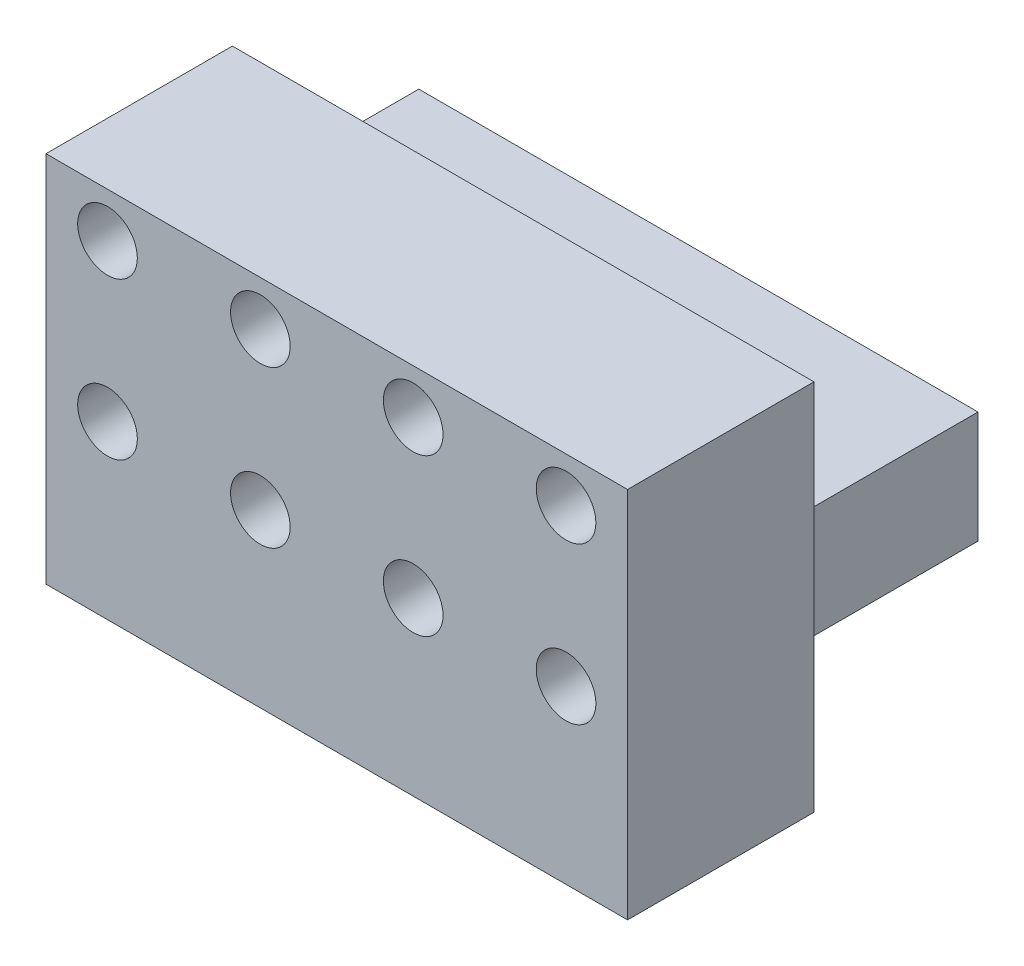
ISO-10303-21;
HEADER;
FILE_DESCRIPTION(('STEP AP214'),'2;1');
FILE_NAME('part.step','',(''),(''),'','','');
FILE_SCHEMA(('AUTOMOTIVE_DESIGN { 1 0 10303 214 1 1 1 1 }'));
ENDSEC;
DATA;
#1=APPLICATION_CONTEXT('core data for automotive mechanical design processes');
#2=APPLICATION_PROTOCOL_DEFINITION('international standard','automotive_design',2000,#1);
#3=PRODUCT_CONTEXT('',#1,'mechanical');
#4=PRODUCT('Part','Part','',(#3));
#5=PRODUCT_RELATED_PRODUCT_CATEGORY('part','',(#4));
#6=PRODUCT_DEFINITION_FORMATION('','',#4);
#7=PRODUCT_DEFINITION_CONTEXT('part definition',#1,'design');
#8=PRODUCT_DEFINITION('design','',#6,#7);
#9=PRODUCT_DEFINITION_SHAPE('','',#8);
#10=(LENGTH_UNIT() NAMED_UNIT(*) SI_UNIT(.MILLI.,.METRE.));
#11=(NAMED_UNIT(*) PLANE_ANGLE_UNIT() SI_UNIT($,.RADIAN.));
#12=(NAMED_UNIT(*) SI_UNIT($,.STERADIAN.) SOLID_ANGLE_UNIT());
#13=UNCERTAINTY_MEASURE_WITH_UNIT(LENGTH_MEASURE(1.E-05),#10,'distance_accuracy_value','');
#14=(GEOMETRIC_REPRESENTATION_CONTEXT(3) GLOBAL_UNCERTAINTY_ASSIGNED_CONTEXT((#13)) GLOBAL_UNIT_ASSIGNED_CONTEXT((#10,
#11,#12)) REPRESENTATION_CONTEXT('',''));
#15=CARTESIAN_POINT('',(0.,0.,0.));
#16=DIRECTION('',(0.,0.,1.));
#17=DIRECTION('',(1.,0.,0.));
#18=AXIS2_PLACEMENT_3D('',#15,#16,#17);
#19=CARTESIAN_POINT('',(0.,7.62,12.7));
#20=DIRECTION('',(-1.,0.,0.));
#21=DIRECTION('',(0.,0.,1.));
#22=AXIS2_PLACEMENT_3D('',#19,#20,#21);
#23=PLANE('',#22);
#24=DIRECTION('',(0.,1.,0.));
#25=VECTOR('',#24,1.);
#26=CARTESIAN_POINT('',(0.,7.62,0.));
#27=LINE('',#26,#25);
#28=CARTESIAN_POINT('',(0.,0.,0.));
#29=VERTEX_POINT('',#28);
#30=CARTESIAN_POINT('',(0.,7.62,0.));
#31=VERTEX_POINT('',#30);
#32=EDGE_CURVE('E129',#29,#31,#27,.T.);
#33=ORIENTED_EDGE('',*,*,#32,.T.);
#34=DIRECTION('',(0.,0.,-1.));
#35=VECTOR('',#34,1.);
#36=CARTESIAN_POINT('',(0.,7.62,12.7));
#37=LINE('',#36,#35);
#38=CARTESIAN_POINT('',(0.,7.62,12.7));
#39=VERTEX_POINT('',#38);
#40=EDGE_CURVE('E11',#39,#31,#37,.T.);
#41=ORIENTED_EDGE('',*,*,#40,.F.);
#42=DIRECTION('',(0.,1.,0.));
#43=VECTOR('',#42,1.);
#44=CARTESIAN_POINT('',(0.,7.62,12.7));
#45=LINE('',#44,#43);
#46=CARTESIAN_POINT('',(0.,0.,12.7));
#47=VERTEX_POINT('',#46);
#48=EDGE_CURVE('E138',#47,#39,#45,.T.);
#49=ORIENTED_EDGE('',*,*,#48,.F.);
#50=DIRECTION('',(0.,0.,-1.));
#51=VECTOR('',#50,1.);
#52=CARTESIAN_POINT('',(0.,0.,12.7));
#53=LINE('',#52,#51);
#54=EDGE_CURVE('E144',#47,#29,#53,.T.);
#55=ORIENTED_EDGE('',*,*,#54,.T.);
#56=EDGE_LOOP('',(#33,#41,#49,#55));
#57=FACE_BOUND('',#56,.T.);
#58=ADVANCED_FACE('F32',(#57),#23,.F.);
#59=CARTESIAN_POINT('',(-38.1,7.62,12.7));
#60=DIRECTION('',(0.,-1.,0.));
#61=DIRECTION('',(1.,0.,0.));
#62=AXIS2_PLACEMENT_3D('',#59,#60,#61);
#63=PLANE('',#62);
#64=DIRECTION('',(-1.,0.,0.));
#65=VECTOR('',#64,1.);
#66=CARTESIAN_POINT('',(-38.1,7.62,0.));
#67=LINE('',#66,#65);
#68=CARTESIAN_POINT('',(-38.1,7.62,0.));
#69=VERTEX_POINT('',#68);
#70=EDGE_CURVE('E132',#31,#69,#67,.T.);
#71=ORIENTED_EDGE('',*,*,#70,.T.);
#72=DIRECTION('',(0.,0.,-1.));
#73=VECTOR('',#72,1.);
#74=CARTESIAN_POINT('',(-38.1,7.62,12.7));
#75=LINE('',#74,#73);
#76=CARTESIAN_POINT('',(-38.1,7.62,12.7));
#77=VERTEX_POINT('',#76);
#78=EDGE_CURVE('E40',#77,#69,#75,.T.);
#79=ORIENTED_EDGE('',*,*,#78,.F.);
#80=DIRECTION('',(-1.,0.,0.));
#81=VECTOR('',#80,1.);
#82=CARTESIAN_POINT('',(-38.1,7.62,12.7));
#83=LINE('',#82,#81);
#84=EDGE_CURVE('E74',#39,#77,#83,.T.);
#85=ORIENTED_EDGE('',*,*,#84,.F.);
#86=ORIENTED_EDGE('',*,*,#40,.T.);
#87=EDGE_LOOP('',(#71,#79,#85,#86));
#88=FACE_BOUND('',#87,.T.);
#89=ADVANCED_FACE('F259',(#88),#63,.F.);
#90=CARTESIAN_POINT('',(-38.1,0.,12.7));
#91=DIRECTION('',(1.,0.,0.));
#92=DIRECTION('',(0.,0.,-1.));
#93=AXIS2_PLACEMENT_3D('',#90,#91,#92);
#94=PLANE('',#93);
#95=DIRECTION('',(0.,-1.,0.));
#96=VECTOR('',#95,1.);
#97=CARTESIAN_POINT('',(-38.1,0.,0.));
#98=LINE('',#97,#96);
#99=CARTESIAN_POINT('',(-38.1,0.,0.));
#100=VERTEX_POINT('',#99);
#101=EDGE_CURVE('E64',#69,#100,#98,.T.);
#102=ORIENTED_EDGE('',*,*,#101,.T.);
#103=DIRECTION('',(0.,0.,-1.));
#104=VECTOR('',#103,1.);
#105=CARTESIAN_POINT('',(-38.1,0.,12.7));
#106=LINE('',#105,#104);
#107=CARTESIAN_POINT('',(-38.1,0.,12.7));
#108=VERTEX_POINT('',#107);
#109=EDGE_CURVE('E48',#108,#100,#106,.T.);
#110=ORIENTED_EDGE('',*,*,#109,.F.);
#111=DIRECTION('',(0.,-1.,0.));
#112=VECTOR('',#111,1.);
#113=CARTESIAN_POINT('',(-38.1,16.51,12.7));
#114=LINE('',#113,#112);
#115=CARTESIAN_POINT('',(-38.1,-8.89,12.7));
#116=VERTEX_POINT('',#115);
#117=EDGE_CURVE('E163',#108,#116,#114,.T.);
#118=ORIENTED_EDGE('',*,*,#117,.T.);
#119=DIRECTION('',(0.,0.,-1.));
#120=VECTOR('',#119,1.);
#121=CARTESIAN_POINT('',(-38.1,-8.89,25.4));
#122=LINE('',#121,#120);
#123=CARTESIAN_POINT('',(-38.1,-8.89,25.4));
#124=VERTEX_POINT('',#123);
#125=EDGE_CURVE('E134',#124,#116,#122,.T.);
#126=ORIENTED_EDGE('',*,*,#125,.F.);
#127=DIRECTION('',(0.,-1.,0.));
#128=VECTOR('',#127,1.);
#129=CARTESIAN_POINT('',(-38.1,16.51,25.4));
#130=LINE('',#129,#128);
#131=CARTESIAN_POINT('',(-38.1,16.51,25.4));
#132=VERTEX_POINT('',#131);
#133=EDGE_CURVE('E114',#132,#124,#130,.T.);
#134=ORIENTED_EDGE('',*,*,#133,.F.);
#135=DIRECTION('',(0.,0.,-1.));
#136=VECTOR('',#135,1.);
#137=CARTESIAN_POINT('',(-38.1,16.51,25.4));
#138=LINE('',#137,#136);
#139=CARTESIAN_POINT('',(-38.1,16.51,12.7));
#140=VERTEX_POINT('',#139);
#141=EDGE_CURVE('E111',#132,#140,#138,.T.);
#142=ORIENTED_EDGE('',*,*,#141,.T.);
#143=EDGE_CURVE('E153',#140,#77,#114,.T.);
#144=ORIENTED_EDGE('',*,*,#143,.T.);
#145=ORIENTED_EDGE('',*,*,#78,.T.);
#146=EDGE_LOOP('',(#102,#110,#118,#126,#134,#142,#144,#145));
#147=FACE_BOUND('',#146,.T.);
#148=ADVANCED_FACE('F151',(#147),#94,.F.);
#149=CARTESIAN_POINT('',(0.,0.,12.7));
#150=DIRECTION('',(0.,1.,0.));
#151=DIRECTION('',(-1.,0.,0.));
#152=AXIS2_PLACEMENT_3D('',#149,#150,#151);
#153=PLANE('',#152);
#154=DIRECTION('',(1.,0.,0.));
#155=VECTOR('',#154,1.);
#156=CARTESIAN_POINT('',(0.,0.,0.));
#157=LINE('',#156,#155);
#158=EDGE_CURVE('E69',#100,#29,#157,.T.);
#159=ORIENTED_EDGE('',*,*,#158,.T.);
#160=ORIENTED_EDGE('',*,*,#54,.F.);
#161=DIRECTION('',(1.,0.,0.));
#162=VECTOR('',#161,1.);
#163=CARTESIAN_POINT('',(0.,0.,12.7));
#164=LINE('',#163,#162);
#165=EDGE_CURVE('E142',#108,#47,#164,.T.);
#166=ORIENTED_EDGE('',*,*,#165,.F.);
#167=ORIENTED_EDGE('',*,*,#109,.T.);
#168=EDGE_LOOP('',(#159,#160,#166,#167));
#169=FACE_BOUND('',#168,.T.);
#170=ADVANCED_FACE('F158',(#169),#153,.F.);
#171=CARTESIAN_POINT('',(0.,0.,0.));
#172=DIRECTION('',(0.,0.,-1.));
#173=DIRECTION('',(-1.,0.,0.));
#174=AXIS2_PLACEMENT_3D('',#171,#172,#173);
#175=PLANE('',#174);
#176=ORIENTED_EDGE('',*,*,#32,.F.);
#177=ORIENTED_EDGE('',*,*,#158,.F.);
#178=ORIENTED_EDGE('',*,*,#101,.F.);
#179=ORIENTED_EDGE('',*,*,#70,.F.);
#180=EDGE_LOOP('',(#176,#177,#178,#179));
#181=FACE_BOUND('',#180,.T.);
#182=ADVANCED_FACE('F156',(#181),#175,.T.);
#183=CARTESIAN_POINT('',(0.,0.,12.7));
#184=DIRECTION('',(0.,0.,1.));
#185=DIRECTION('',(1.,0.,0.));
#186=AXIS2_PLACEMENT_3D('',#183,#184,#185);
#187=PLANE('',#186);
#188=ORIENTED_EDGE('',*,*,#48,.T.);
#189=ORIENTED_EDGE('',*,*,#84,.T.);
#190=ORIENTED_EDGE('',*,*,#143,.F.);
#191=DIRECTION('',(-1.,0.,0.));
#192=VECTOR('',#191,1.);
#193=CARTESIAN_POINT('',(-38.1,16.51,12.7));
#194=LINE('',#193,#192);
#195=CARTESIAN_POINT('',(1.52399999999999,16.51,12.7));
#196=VERTEX_POINT('',#195);
#197=EDGE_CURVE('E166',#196,#140,#194,.T.);
#198=ORIENTED_EDGE('',*,*,#197,.F.);
#199=DIRECTION('',(0.,1.,0.));
#200=VECTOR('',#199,1.);
#201=CARTESIAN_POINT('',(1.52399999999999,16.51,12.7));
#202=LINE('',#201,#200);
#203=CARTESIAN_POINT('',(1.524,-8.88999999999997,12.7));
#204=VERTEX_POINT('',#203);
#205=EDGE_CURVE('E128',#204,#196,#202,.T.);
#206=ORIENTED_EDGE('',*,*,#205,.F.);
#207=DIRECTION('',(1.,0.,0.));
#208=VECTOR('',#207,1.);
#209=CARTESIAN_POINT('',(-38.1,-8.89,12.7));
#210=LINE('',#209,#208);
#211=EDGE_CURVE('E124',#116,#204,#210,.T.);
#212=ORIENTED_EDGE('',*,*,#211,.F.);
#213=ORIENTED_EDGE('',*,*,#117,.F.);
#214=ORIENTED_EDGE('',*,*,#165,.T.);
#215=EDGE_LOOP('',(#188,#189,#190,#198,#206,#212,#213,#214));
#216=FACE_BOUND('',#215,.T.);
#217=ADVANCED_FACE('F161',(#216),#187,.F.);
#218=CARTESIAN_POINT('',(1.52399999999999,16.51,25.4));
#219=DIRECTION('',(-1.,0.,0.));
#220=DIRECTION('',(0.,-1.,0.));
#221=AXIS2_PLACEMENT_3D('',#218,#219,#220);
#222=PLANE('',#221);
#223=ORIENTED_EDGE('',*,*,#205,.T.);
#224=DIRECTION('',(0.,0.,-1.));
#225=VECTOR('',#224,1.);
#226=CARTESIAN_POINT('',(1.52399999999999,16.51,25.4));
#227=LINE('',#226,#225);
#228=CARTESIAN_POINT('',(1.52399999999999,16.51,25.4));
#229=VERTEX_POINT('',#228);
#230=EDGE_CURVE('E108',#229,#196,#227,.T.);
#231=ORIENTED_EDGE('',*,*,#230,.F.);
#232=DIRECTION('',(0.,1.,0.));
#233=VECTOR('',#232,1.);
#234=CARTESIAN_POINT('',(1.52399999999999,16.51,25.4));
#235=LINE('',#234,#233);
#236=CARTESIAN_POINT('',(1.524,-8.88999999999997,25.4));
#237=VERTEX_POINT('',#236);
#238=EDGE_CURVE('E115',#237,#229,#235,.T.);
#239=ORIENTED_EDGE('',*,*,#238,.F.);
#240=DIRECTION('',(0.,0.,-1.));
#241=VECTOR('',#240,1.);
#242=CARTESIAN_POINT('',(1.524,-8.88999999999997,25.4));
#243=LINE('',#242,#241);
#244=EDGE_CURVE('E172',#237,#204,#243,.T.);
#245=ORIENTED_EDGE('',*,*,#244,.T.);
#246=EDGE_LOOP('',(#223,#231,#239,#245));
#247=FACE_BOUND('',#246,.T.);
#248=ADVANCED_FACE('F126',(#247),#222,.F.);
#249=CARTESIAN_POINT('',(-38.1,16.51,25.4));
#250=DIRECTION('',(0.,-1.,0.));
#251=DIRECTION('',(0.,0.,-1.));
#252=AXIS2_PLACEMENT_3D('',#249,#250,#251);
#253=PLANE('',#252);
#254=ORIENTED_EDGE('',*,*,#197,.T.);
#255=ORIENTED_EDGE('',*,*,#141,.F.);
#256=DIRECTION('',(-1.,0.,0.));
#257=VECTOR('',#256,1.);
#258=CARTESIAN_POINT('',(-38.1,16.51,25.4));
#259=LINE('',#258,#257);
#260=EDGE_CURVE('E104',#229,#132,#259,.T.);
#261=ORIENTED_EDGE('',*,*,#260,.F.);
#262=ORIENTED_EDGE('',*,*,#230,.T.);
#263=EDGE_LOOP('',(#254,#255,#261,#262));
#264=FACE_BOUND('',#263,.T.);
#265=ADVANCED_FACE('F106',(#264),#253,.F.);
#266=CARTESIAN_POINT('',(-38.1,-8.89,25.4));
#267=DIRECTION('',(0.,1.,0.));
#268=DIRECTION('',(-1.,0.,0.));
#269=AXIS2_PLACEMENT_3D('',#266,#267,#268);
#270=PLANE('',#269);
#271=ORIENTED_EDGE('',*,*,#211,.T.);
#272=ORIENTED_EDGE('',*,*,#244,.F.);
#273=DIRECTION('',(1.,0.,0.));
#274=VECTOR('',#273,1.);
#275=CARTESIAN_POINT('',(-38.1,-8.89,25.4));
#276=LINE('',#275,#274);
#277=EDGE_CURVE('E120',#124,#237,#276,.T.);
#278=ORIENTED_EDGE('',*,*,#277,.F.);
#279=ORIENTED_EDGE('',*,*,#125,.T.);
#280=EDGE_LOOP('',(#271,#272,#278,#279));
#281=FACE_BOUND('',#280,.T.);
#282=ADVANCED_FACE('F174',(#281),#270,.F.);
#283=CARTESIAN_POINT('',(0.,0.,25.4));
#284=DIRECTION('',(0.,0.,1.));
#285=DIRECTION('',(1.,0.,0.));
#286=AXIS2_PLACEMENT_3D('',#283,#284,#285);
#287=PLANE('',#286);
#288=CARTESIAN_POINT('',(-23.495,13.462,25.4));
#289=DIRECTION('',(0.,0.,1.));
#290=DIRECTION('',(1.,0.,0.));
#291=AXIS2_PLACEMENT_3D('',#288,#289,#290);
#292=CIRCLE('',#291,2.032);
#293=CARTESIAN_POINT('',(-21.463,13.462,25.4));
#294=VERTEX_POINT('',#293);
#295=EDGE_CURVE('E206',#294,#294,#292,.T.);
#296=ORIENTED_EDGE('',*,*,#295,.F.);
#297=EDGE_LOOP('',(#296));
#298=FACE_BOUND('',#297,.T.);
#299=CARTESIAN_POINT('',(-2.66700000000001,13.462,25.4));
#300=DIRECTION('',(0.,0.,1.));
#301=DIRECTION('',(1.,0.,0.));
#302=AXIS2_PLACEMENT_3D('',#299,#300,#301);
#303=CIRCLE('',#302,2.032);
#304=CARTESIAN_POINT('',(-0.635000000000009,13.462,25.4));
#305=VERTEX_POINT('',#304);
#306=EDGE_CURVE('E200',#305,#305,#303,.T.);
#307=ORIENTED_EDGE('',*,*,#306,.F.);
#308=EDGE_LOOP('',(#307));
#309=FACE_BOUND('',#308,.T.);
#310=CARTESIAN_POINT('',(-13.081,2.794,25.4));
#311=DIRECTION('',(0.,0.,1.));
#312=DIRECTION('',(1.,0.,0.));
#313=AXIS2_PLACEMENT_3D('',#310,#311,#312);
#314=CIRCLE('',#313,2.032);
#315=CARTESIAN_POINT('',(-11.049,2.794,25.4));
#316=VERTEX_POINT('',#315);
#317=EDGE_CURVE('E194',#316,#316,#314,.T.);
#318=ORIENTED_EDGE('',*,*,#317,.F.);
#319=EDGE_LOOP('',(#318));
#320=FACE_BOUND('',#319,.T.);
#321=CARTESIAN_POINT('',(-23.495,2.794,25.4));
#322=DIRECTION('',(0.,0.,1.));
#323=DIRECTION('',(1.,0.,0.));
#324=AXIS2_PLACEMENT_3D('',#321,#322,#323);
#325=CIRCLE('',#324,2.032);
#326=CARTESIAN_POINT('',(-21.463,2.794,25.4));
#327=VERTEX_POINT('',#326);
#328=EDGE_CURVE('E187',#327,#327,#325,.T.);
#329=ORIENTED_EDGE('',*,*,#328,.F.);
#330=EDGE_LOOP('',(#329));
#331=FACE_BOUND('',#330,.T.);
#332=CARTESIAN_POINT('',(-33.909,2.794,25.4));
#333=DIRECTION('',(0.,0.,1.));
#334=DIRECTION('',(1.,0.,0.));
#335=AXIS2_PLACEMENT_3D('',#332,#333,#334);
#336=CIRCLE('',#335,2.032);
#337=CARTESIAN_POINT('',(-31.877,2.794,25.4));
#338=VERTEX_POINT('',#337);
#339=EDGE_CURVE('E223',#338,#338,#336,.T.);
#340=ORIENTED_EDGE('',*,*,#339,.F.);
#341=EDGE_LOOP('',(#340));
#342=FACE_BOUND('',#341,.T.);
#343=CARTESIAN_POINT('',(-13.081,13.462,25.4));
#344=DIRECTION('',(0.,0.,1.));
#345=DIRECTION('',(1.,0.,0.));
#346=AXIS2_PLACEMENT_3D('',#343,#344,#345);
#347=CIRCLE('',#346,2.032);
#348=CARTESIAN_POINT('',(-11.049,13.462,25.4));
#349=VERTEX_POINT('',#348);
#350=EDGE_CURVE('E217',#349,#349,#347,.T.);
#351=ORIENTED_EDGE('',*,*,#350,.F.);
#352=EDGE_LOOP('',(#351));
#353=FACE_BOUND('',#352,.T.);
#354=CARTESIAN_POINT('',(-2.66700000000001,2.794,25.4));
#355=DIRECTION('',(0.,0.,1.));
#356=DIRECTION('',(1.,0.,0.));
#357=AXIS2_PLACEMENT_3D('',#354,#355,#356);
#358=CIRCLE('',#357,2.032);
#359=CARTESIAN_POINT('',(-0.63500000000001,2.794,25.4));
#360=VERTEX_POINT('',#359);
#361=EDGE_CURVE('E211',#360,#360,#358,.T.);
#362=ORIENTED_EDGE('',*,*,#361,.F.);
#363=EDGE_LOOP('',(#362));
#364=FACE_BOUND('',#363,.T.);
#365=CARTESIAN_POINT('',(-33.909,13.462,25.4));
#366=DIRECTION('',(0.,0.,1.));
#367=DIRECTION('',(1.,0.,0.));
#368=AXIS2_PLACEMENT_3D('',#365,#366,#367);
#369=CIRCLE('',#368,2.032);
#370=CARTESIAN_POINT('',(-31.877,13.462,25.4));
#371=VERTEX_POINT('',#370);
#372=EDGE_CURVE('E179',#371,#371,#369,.T.);
#373=ORIENTED_EDGE('',*,*,#372,.F.);
#374=EDGE_LOOP('',(#373));
#375=FACE_BOUND('',#374,.T.);
#376=ORIENTED_EDGE('',*,*,#238,.T.);
#377=ORIENTED_EDGE('',*,*,#260,.T.);
#378=ORIENTED_EDGE('',*,*,#133,.T.);
#379=ORIENTED_EDGE('',*,*,#277,.T.);
#380=EDGE_LOOP('',(#376,#377,#378,#379));
#381=FACE_BOUND('',#380,.T.);
#382=ADVANCED_FACE('F118',(#298,#309,#320,#331,#342,#353,#364,#375,#381),#287,.T.);
#383=CARTESIAN_POINT('',(-33.909,13.462,17.78));
#384=DIRECTION('',(0.,0.,1.));
#385=DIRECTION('',(1.,0.,0.));
#386=AXIS2_PLACEMENT_3D('',#383,#384,#385);
#387=CYLINDRICAL_SURFACE('',#386,2.032);
#388=CARTESIAN_POINT('',(-33.909,13.462,17.78));
#389=DIRECTION('',(0.,0.,1.));
#390=DIRECTION('',(1.,0.,0.));
#391=AXIS2_PLACEMENT_3D('',#388,#389,#390);
#392=CIRCLE('',#391,2.032);
#393=CARTESIAN_POINT('',(-31.877,13.462,17.78));
#394=VERTEX_POINT('',#393);
#395=EDGE_CURVE('E177',#394,#394,#392,.T.);
#396=ORIENTED_EDGE('',*,*,#395,.F.);
#397=EDGE_LOOP('',(#396));
#398=FACE_BOUND('',#397,.T.);
#399=ORIENTED_EDGE('',*,*,#372,.T.);
#400=EDGE_LOOP('',(#399));
#401=FACE_BOUND('',#400,.T.);
#402=ADVANCED_FACE('F240',(#398,#401),#387,.F.);
#403=CARTESIAN_POINT('',(-33.909,13.462,17.78));
#404=DIRECTION('',(0.,0.,1.));
#405=DIRECTION('',(1.,0.,0.));
#406=AXIS2_PLACEMENT_3D('',#403,#404,#405);
#407=PLANE('',#406);
#408=ORIENTED_EDGE('',*,*,#395,.T.);
#409=EDGE_LOOP('',(#408));
#410=FACE_BOUND('',#409,.T.);
#411=ADVANCED_FACE('F250',(#410),#407,.T.);
#412=CARTESIAN_POINT('',(-2.66700000000001,2.794,17.78));
#413=DIRECTION('',(0.,0.,1.));
#414=DIRECTION('',(1.,0.,0.));
#415=AXIS2_PLACEMENT_3D('',#412,#413,#414);
#416=CYLINDRICAL_SURFACE('',#415,2.032);
#417=CARTESIAN_POINT('',(-2.66700000000001,2.794,17.78));
#418=DIRECTION('',(0.,0.,1.));
#419=DIRECTION('',(1.,0.,0.));
#420=AXIS2_PLACEMENT_3D('',#417,#418,#419);
#421=CIRCLE('',#420,2.032);
#422=CARTESIAN_POINT('',(-0.63500000000001,2.794,17.78));
#423=VERTEX_POINT('',#422);
#424=EDGE_CURVE('E214',#423,#423,#421,.T.);
#425=ORIENTED_EDGE('',*,*,#424,.F.);
#426=EDGE_LOOP('',(#425));
#427=FACE_BOUND('',#426,.T.);
#428=ORIENTED_EDGE('',*,*,#361,.T.);
#429=EDGE_LOOP('',(#428));
#430=FACE_BOUND('',#429,.T.);
#431=ADVANCED_FACE('F256',(#427,#430),#416,.F.);
#432=CARTESIAN_POINT('',(-2.66700000000001,2.794,17.78));
#433=DIRECTION('',(0.,0.,1.));
#434=DIRECTION('',(1.,0.,0.));
#435=AXIS2_PLACEMENT_3D('',#432,#433,#434);
#436=PLANE('',#435);
#437=ORIENTED_EDGE('',*,*,#424,.T.);
#438=EDGE_LOOP('',(#437));
#439=FACE_BOUND('',#438,.T.);
#440=ADVANCED_FACE('F319',(#439),#436,.T.);
#441=CARTESIAN_POINT('',(-13.081,13.462,17.78));
#442=DIRECTION('',(0.,0.,1.));
#443=DIRECTION('',(1.,0.,0.));
#444=AXIS2_PLACEMENT_3D('',#441,#442,#443);
#445=CYLINDRICAL_SURFACE('',#444,2.032);
#446=CARTESIAN_POINT('',(-13.081,13.462,17.78));
#447=DIRECTION('',(0.,0.,1.));
#448=DIRECTION('',(1.,0.,0.));
#449=AXIS2_PLACEMENT_3D('',#446,#447,#448);
#450=CIRCLE('',#449,2.032);
#451=CARTESIAN_POINT('',(-11.049,13.462,17.78));
#452=VERTEX_POINT('',#451);
#453=EDGE_CURVE('E220',#452,#452,#450,.T.);
#454=ORIENTED_EDGE('',*,*,#453,.F.);
#455=EDGE_LOOP('',(#454));
#456=FACE_BOUND('',#455,.T.);
#457=ORIENTED_EDGE('',*,*,#350,.T.);
#458=EDGE_LOOP('',(#457));
#459=FACE_BOUND('',#458,.T.);
#460=ADVANCED_FACE('F329',(#456,#459),#445,.F.);
#461=CARTESIAN_POINT('',(-13.081,13.462,17.78));
#462=DIRECTION('',(0.,0.,1.));
#463=DIRECTION('',(1.,0.,0.));
#464=AXIS2_PLACEMENT_3D('',#461,#462,#463);
#465=PLANE('',#464);
#466=ORIENTED_EDGE('',*,*,#453,.T.);
#467=EDGE_LOOP('',(#466));
#468=FACE_BOUND('',#467,.T.);
#469=ADVANCED_FACE('F234',(#468),#465,.T.);
#470=CARTESIAN_POINT('',(-33.909,2.794,17.78));
#471=DIRECTION('',(0.,0.,1.));
#472=DIRECTION('',(1.,0.,0.));
#473=AXIS2_PLACEMENT_3D('',#470,#471,#472);
#474=CYLINDRICAL_SURFACE('',#473,2.032);
#475=CARTESIAN_POINT('',(-33.909,2.794,17.78));
#476=DIRECTION('',(0.,0.,1.));
#477=DIRECTION('',(1.,0.,0.));
#478=AXIS2_PLACEMENT_3D('',#475,#476,#477);
#479=CIRCLE('',#478,2.032);
#480=CARTESIAN_POINT('',(-31.877,2.794,17.78));
#481=VERTEX_POINT('',#480);
#482=EDGE_CURVE('E191',#481,#481,#479,.T.);
#483=ORIENTED_EDGE('',*,*,#482,.F.);
#484=EDGE_LOOP('',(#483));
#485=FACE_BOUND('',#484,.T.);
#486=ORIENTED_EDGE('',*,*,#339,.T.);
#487=EDGE_LOOP('',(#486));
#488=FACE_BOUND('',#487,.T.);
#489=ADVANCED_FACE('F231',(#485,#488),#474,.F.);
#490=CARTESIAN_POINT('',(-33.909,2.794,17.78));
#491=DIRECTION('',(0.,0.,1.));
#492=DIRECTION('',(1.,0.,0.));
#493=AXIS2_PLACEMENT_3D('',#490,#491,#492);
#494=PLANE('',#493);
#495=ORIENTED_EDGE('',*,*,#482,.T.);
#496=EDGE_LOOP('',(#495));
#497=FACE_BOUND('',#496,.T.);
#498=ADVANCED_FACE('F229',(#497),#494,.T.);
#499=CARTESIAN_POINT('',(-23.495,2.794,17.78));
#500=DIRECTION('',(0.,0.,1.));
#501=DIRECTION('',(1.,0.,0.));
#502=AXIS2_PLACEMENT_3D('',#499,#500,#501);
#503=CYLINDRICAL_SURFACE('',#502,2.032);
#504=CARTESIAN_POINT('',(-23.495,2.794,17.78));
#505=DIRECTION('',(0.,0.,1.));
#506=DIRECTION('',(1.,0.,0.));
#507=AXIS2_PLACEMENT_3D('',#504,#505,#506);
#508=CIRCLE('',#507,2.032);
#509=CARTESIAN_POINT('',(-21.463,2.794,17.78));
#510=VERTEX_POINT('',#509);
#511=EDGE_CURVE('E190',#510,#510,#508,.T.);
#512=ORIENTED_EDGE('',*,*,#511,.F.);
#513=EDGE_LOOP('',(#512));
#514=FACE_BOUND('',#513,.T.);
#515=ORIENTED_EDGE('',*,*,#328,.T.);
#516=EDGE_LOOP('',(#515));
#517=FACE_BOUND('',#516,.T.);
#518=ADVANCED_FACE('F363',(#514,#517),#503,.F.);
#519=CARTESIAN_POINT('',(-23.495,2.794,17.78));
#520=DIRECTION('',(0.,0.,1.));
#521=DIRECTION('',(1.,0.,0.));
#522=AXIS2_PLACEMENT_3D('',#519,#520,#521);
#523=PLANE('',#522);
#524=ORIENTED_EDGE('',*,*,#511,.T.);
#525=EDGE_LOOP('',(#524));
#526=FACE_BOUND('',#525,.T.);
#527=ADVANCED_FACE('F372',(#526),#523,.T.);
#528=CARTESIAN_POINT('',(-13.081,2.794,17.78));
#529=DIRECTION('',(0.,0.,1.));
#530=DIRECTION('',(1.,0.,0.));
#531=AXIS2_PLACEMENT_3D('',#528,#529,#530);
#532=CYLINDRICAL_SURFACE('',#531,2.032);
#533=CARTESIAN_POINT('',(-13.081,2.794,17.78));
#534=DIRECTION('',(0.,0.,1.));
#535=DIRECTION('',(1.,0.,0.));
#536=AXIS2_PLACEMENT_3D('',#533,#534,#535);
#537=CIRCLE('',#536,2.032);
#538=CARTESIAN_POINT('',(-11.049,2.794,17.78));
#539=VERTEX_POINT('',#538);
#540=EDGE_CURVE('E197',#539,#539,#537,.T.);
#541=ORIENTED_EDGE('',*,*,#540,.F.);
#542=EDGE_LOOP('',(#541));
#543=FACE_BOUND('',#542,.T.);
#544=ORIENTED_EDGE('',*,*,#317,.T.);
#545=EDGE_LOOP('',(#544));
#546=FACE_BOUND('',#545,.T.);
#547=ADVANCED_FACE('F382',(#543,#546),#532,.F.);
#548=CARTESIAN_POINT('',(-13.081,2.794,17.78));
#549=DIRECTION('',(0.,0.,1.));
#550=DIRECTION('',(1.,0.,0.));
#551=AXIS2_PLACEMENT_3D('',#548,#549,#550);
#552=PLANE('',#551);
#553=ORIENTED_EDGE('',*,*,#540,.T.);
#554=EDGE_LOOP('',(#553));
#555=FACE_BOUND('',#554,.T.);
#556=ADVANCED_FACE('F392',(#555),#552,.T.);
#557=CARTESIAN_POINT('',(-2.66700000000001,13.462,17.78));
#558=DIRECTION('',(0.,0.,1.));
#559=DIRECTION('',(1.,0.,0.));
#560=AXIS2_PLACEMENT_3D('',#557,#558,#559);
#561=CYLINDRICAL_SURFACE('',#560,2.032);
#562=CARTESIAN_POINT('',(-2.66700000000001,13.462,17.78));
#563=DIRECTION('',(0.,0.,1.));
#564=DIRECTION('',(1.,0.,0.));
#565=AXIS2_PLACEMENT_3D('',#562,#563,#564);
#566=CIRCLE('',#565,2.032);
#567=CARTESIAN_POINT('',(-0.635000000000009,13.462,17.78));
#568=VERTEX_POINT('',#567);
#569=EDGE_CURVE('E203',#568,#568,#566,.T.);
#570=ORIENTED_EDGE('',*,*,#569,.F.);
#571=EDGE_LOOP('',(#570));
#572=FACE_BOUND('',#571,.T.);
#573=ORIENTED_EDGE('',*,*,#306,.T.);
#574=EDGE_LOOP('',(#573));
#575=FACE_BOUND('',#574,.T.);
#576=ADVANCED_FACE('F402',(#572,#575),#561,.F.);
#577=CARTESIAN_POINT('',(-2.66700000000001,13.462,17.78));
#578=DIRECTION('',(0.,0.,1.));
#579=DIRECTION('',(1.,0.,0.));
#580=AXIS2_PLACEMENT_3D('',#577,#578,#579);
#581=PLANE('',#580);
#582=ORIENTED_EDGE('',*,*,#569,.T.);
#583=EDGE_LOOP('',(#582));
#584=FACE_BOUND('',#583,.T.);
#585=ADVANCED_FACE('F412',(#584),#581,.T.);
#586=CARTESIAN_POINT('',(-23.495,13.462,17.78));
#587=DIRECTION('',(0.,0.,1.));
#588=DIRECTION('',(1.,0.,0.));
#589=AXIS2_PLACEMENT_3D('',#586,#587,#588);
#590=CYLINDRICAL_SURFACE('',#589,2.032);
#591=CARTESIAN_POINT('',(-23.495,13.462,17.78));
#592=DIRECTION('',(0.,0.,1.));
#593=DIRECTION('',(1.,0.,0.));
#594=AXIS2_PLACEMENT_3D('',#591,#592,#593);
#595=CIRCLE('',#594,2.032);
#596=CARTESIAN_POINT('',(-21.463,13.462,17.78));
#597=VERTEX_POINT('',#596);
#598=EDGE_CURVE('E184',#597,#597,#595,.T.);
#599=ORIENTED_EDGE('',*,*,#598,.F.);
#600=EDGE_LOOP('',(#599));
#601=FACE_BOUND('',#600,.T.);
#602=ORIENTED_EDGE('',*,*,#295,.T.);
#603=EDGE_LOOP('',(#602));
#604=FACE_BOUND('',#603,.T.);
#605=ADVANCED_FACE('F422',(#601,#604),#590,.F.);
#606=CARTESIAN_POINT('',(-23.495,13.462,17.78));
#607=DIRECTION('',(0.,0.,1.));
#608=DIRECTION('',(1.,0.,0.));
#609=AXIS2_PLACEMENT_3D('',#606,#607,#608);
#610=PLANE('',#609);
#611=ORIENTED_EDGE('',*,*,#598,.T.);
#612=EDGE_LOOP('',(#611));
#613=FACE_BOUND('',#612,.T.);
#614=ADVANCED_FACE('F432',(#613),#610,.T.);
#615=CLOSED_SHELL('',(#58,#89,#148,#170,#182,#217,#248,#265,#282,#382,#402,#411,#431,#440,#460,
#469,#489,#498,#518,#527,#547,#556,#576,#585,#605,#614));
#616=MANIFOLD_SOLID_BREP('B2',#615);
#617=ADVANCED_BREP_SHAPE_REPRESENTATION('',(#18,#616),#14);
#618=SHAPE_DEFINITION_REPRESENTATION(#9,#617);
ENDSEC;
END-ISO-10303-21;
